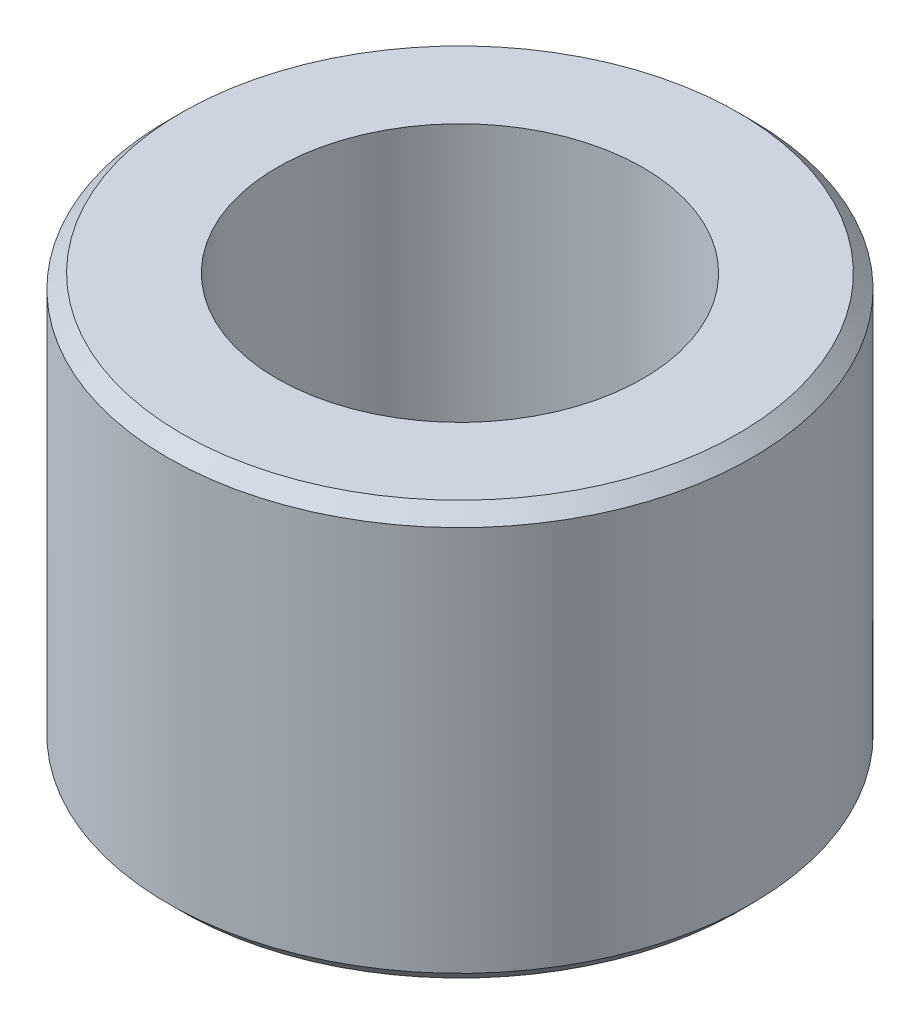
ISO-10303-21;
HEADER;
FILE_DESCRIPTION(('STEP AP214'),'2;1');
FILE_NAME('part.step','',(''),(''),'','','');
FILE_SCHEMA(('AUTOMOTIVE_DESIGN { 1 0 10303 214 1 1 1 1 }'));
ENDSEC;
DATA;
#1=APPLICATION_CONTEXT('core data for automotive mechanical design processes');
#2=APPLICATION_PROTOCOL_DEFINITION('international standard','automotive_design',2000,#1);
#3=PRODUCT_CONTEXT('',#1,'mechanical');
#4=PRODUCT('Part','Part','',(#3));
#5=PRODUCT_RELATED_PRODUCT_CATEGORY('part','',(#4));
#6=PRODUCT_DEFINITION_FORMATION('','',#4);
#7=PRODUCT_DEFINITION_CONTEXT('part definition',#1,'design');
#8=PRODUCT_DEFINITION('design','',#6,#7);
#9=PRODUCT_DEFINITION_SHAPE('','',#8);
#10=(LENGTH_UNIT() NAMED_UNIT(*) SI_UNIT(.MILLI.,.METRE.));
#11=(NAMED_UNIT(*) PLANE_ANGLE_UNIT() SI_UNIT($,.RADIAN.));
#12=(NAMED_UNIT(*) SI_UNIT($,.STERADIAN.) SOLID_ANGLE_UNIT());
#13=UNCERTAINTY_MEASURE_WITH_UNIT(LENGTH_MEASURE(1.E-05),#10,'distance_accuracy_value','');
#14=(GEOMETRIC_REPRESENTATION_CONTEXT(3) GLOBAL_UNCERTAINTY_ASSIGNED_CONTEXT((#13)) GLOBAL_UNIT_ASSIGNED_CONTEXT((#10,
#11,#12)) REPRESENTATION_CONTEXT('',''));
#15=CARTESIAN_POINT('',(0.,0.,0.));
#16=DIRECTION('',(0.,0.,1.));
#17=DIRECTION('',(1.,0.,0.));
#18=AXIS2_PLACEMENT_3D('',#15,#16,#17);
#19=CARTESIAN_POINT('',(0.,0.,0.));
#20=DIRECTION('',(0.,-1.,0.));
#21=DIRECTION('',(0.,0.,-1.));
#22=AXIS2_PLACEMENT_3D('',#19,#20,#21);
#23=CYLINDRICAL_SURFACE('',#22,10.668);
#24=CARTESIAN_POINT('',(0.,-14.605,0.));
#25=DIRECTION('',(0.,-1.,0.));
#26=DIRECTION('',(0.,0.,-1.));
#27=AXIS2_PLACEMENT_3D('',#24,#25,#26);
#28=CIRCLE('',#27,10.668);
#29=CARTESIAN_POINT('',(0.,-14.605,-10.668));
#30=VERTEX_POINT('',#29);
#31=EDGE_CURVE('E37',#30,#30,#28,.F.);
#32=ORIENTED_EDGE('',*,*,#31,.T.);
#33=EDGE_LOOP('',(#32));
#34=FACE_BOUND('',#33,.T.);
#35=CARTESIAN_POINT('',(0.,-0.508,0.));
#36=DIRECTION('',(0.,1.,0.));
#37=DIRECTION('',(0.,0.,1.));
#38=AXIS2_PLACEMENT_3D('',#35,#36,#37);
#39=CIRCLE('',#38,10.668);
#40=CARTESIAN_POINT('',(0.,-0.508,10.668));
#41=VERTEX_POINT('',#40);
#42=EDGE_CURVE('E41',#41,#41,#39,.F.);
#43=ORIENTED_EDGE('',*,*,#42,.T.);
#44=EDGE_LOOP('',(#43));
#45=FACE_BOUND('',#44,.T.);
#46=ADVANCED_FACE('F30',(#34,#45),#23,.T.);
#47=CARTESIAN_POINT('',(10.668,0.,0.));
#48=DIRECTION('',(0.,1.,0.));
#49=DIRECTION('',(0.,0.,1.));
#50=AXIS2_PLACEMENT_3D('',#47,#48,#49);
#51=PLANE('',#50);
#52=CARTESIAN_POINT('',(0.,0.,0.));
#53=DIRECTION('',(0.,1.,0.));
#54=DIRECTION('',(0.,0.,1.));
#55=AXIS2_PLACEMENT_3D('',#52,#53,#54);
#56=CIRCLE('',#55,10.16);
#57=CARTESIAN_POINT('',(0.,0.,10.16));
#58=VERTEX_POINT('',#57);
#59=EDGE_CURVE('E10',#58,#58,#56,.T.);
#60=ORIENTED_EDGE('',*,*,#59,.T.);
#61=EDGE_LOOP('',(#60));
#62=FACE_BOUND('',#61,.T.);
#63=CARTESIAN_POINT('',(0.,0.,0.));
#64=DIRECTION('',(0.,-1.,0.));
#65=DIRECTION('',(0.,0.,-1.));
#66=AXIS2_PLACEMENT_3D('',#63,#64,#65);
#67=CIRCLE('',#66,6.6802);
#68=CARTESIAN_POINT('',(0.,0.,-6.6802));
#69=VERTEX_POINT('',#68);
#70=EDGE_CURVE('E50',#69,#69,#67,.T.);
#71=ORIENTED_EDGE('',*,*,#70,.T.);
#72=EDGE_LOOP('',(#71));
#73=FACE_BOUND('',#72,.T.);
#74=ADVANCED_FACE('F70',(#62,#73),#51,.T.);
#75=CARTESIAN_POINT('',(0.,0.,0.));
#76=DIRECTION('',(0.,-1.,0.));
#77=DIRECTION('',(0.,0.,-1.));
#78=AXIS2_PLACEMENT_3D('',#75,#76,#77);
#79=CYLINDRICAL_SURFACE('',#78,6.6802);
#80=CARTESIAN_POINT('',(0.,-15.113,0.));
#81=DIRECTION('',(0.,-1.,0.));
#82=DIRECTION('',(0.,0.,-1.));
#83=AXIS2_PLACEMENT_3D('',#80,#81,#82);
#84=CIRCLE('',#83,6.6802);
#85=CARTESIAN_POINT('',(0.,-15.113,-6.6802));
#86=VERTEX_POINT('',#85);
#87=EDGE_CURVE('E53',#86,#86,#84,.T.);
#88=ORIENTED_EDGE('',*,*,#87,.T.);
#89=EDGE_LOOP('',(#88));
#90=FACE_BOUND('',#89,.T.);
#91=ORIENTED_EDGE('',*,*,#70,.F.);
#92=EDGE_LOOP('',(#91));
#93=FACE_BOUND('',#92,.T.);
#94=ADVANCED_FACE('F57',(#90,#93),#79,.F.);
#95=CARTESIAN_POINT('',(6.6802,-15.113,0.));
#96=DIRECTION('',(0.,-1.,0.));
#97=DIRECTION('',(0.,0.,-1.));
#98=AXIS2_PLACEMENT_3D('',#95,#96,#97);
#99=PLANE('',#98);
#100=CARTESIAN_POINT('',(0.,-15.113,0.));
#101=DIRECTION('',(0.,-1.,0.));
#102=DIRECTION('',(0.,0.,-1.));
#103=AXIS2_PLACEMENT_3D('',#100,#101,#102);
#104=CIRCLE('',#103,10.16);
#105=CARTESIAN_POINT('',(0.,-15.113,-10.16));
#106=VERTEX_POINT('',#105);
#107=EDGE_CURVE('E45',#106,#106,#104,.T.);
#108=ORIENTED_EDGE('',*,*,#107,.T.);
#109=EDGE_LOOP('',(#108));
#110=FACE_BOUND('',#109,.T.);
#111=ORIENTED_EDGE('',*,*,#87,.F.);
#112=EDGE_LOOP('',(#111));
#113=FACE_BOUND('',#112,.T.);
#114=ADVANCED_FACE('F60',(#110,#113),#99,.T.);
#115=CARTESIAN_POINT('',(0.,-15.113,0.));
#116=DIRECTION('',(0.,1.,0.));
#117=DIRECTION('',(0.,0.,1.));
#118=AXIS2_PLACEMENT_3D('',#115,#116,#117);
#119=CONICAL_SURFACE('',#118,10.16,0.785398163397447);
#120=ORIENTED_EDGE('',*,*,#31,.F.);
#121=EDGE_LOOP('',(#120));
#122=FACE_BOUND('',#121,.T.);
#123=ORIENTED_EDGE('',*,*,#107,.F.);
#124=EDGE_LOOP('',(#123));
#125=FACE_BOUND('',#124,.T.);
#126=ADVANCED_FACE('F62',(#122,#125),#119,.T.);
#127=CARTESIAN_POINT('',(0.,-0.508,0.));
#128=DIRECTION('',(0.,-1.,0.));
#129=DIRECTION('',(0.,0.,-1.));
#130=AXIS2_PLACEMENT_3D('',#127,#128,#129);
#131=CONICAL_SURFACE('',#130,10.668,0.785398163397448);
#132=ORIENTED_EDGE('',*,*,#59,.F.);
#133=EDGE_LOOP('',(#132));
#134=FACE_BOUND('',#133,.T.);
#135=ORIENTED_EDGE('',*,*,#42,.F.);
#136=EDGE_LOOP('',(#135));
#137=FACE_BOUND('',#136,.T.);
#138=ADVANCED_FACE('F32',(#134,#137),#131,.T.);
#139=CLOSED_SHELL('',(#46,#74,#94,#114,#126,#138));
#140=MANIFOLD_SOLID_BREP('B2',#139);
#141=ADVANCED_BREP_SHAPE_REPRESENTATION('',(#18,#140),#14);
#142=SHAPE_DEFINITION_REPRESENTATION(#9,#141);
ENDSEC;
END-ISO-10303-21;
